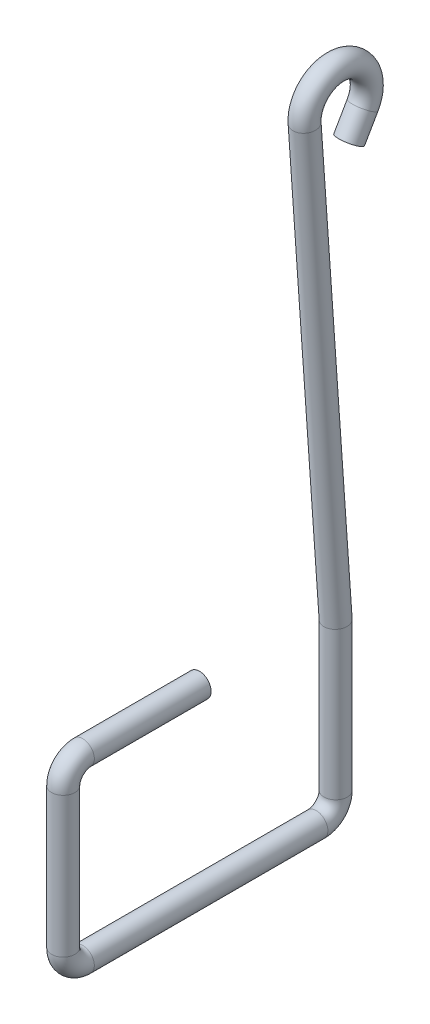
ISO-10303-21;
HEADER;
FILE_DESCRIPTION(('STEP AP214'),'2;1');
FILE_NAME('part.step','',(''),(''),'','','');
FILE_SCHEMA(('AUTOMOTIVE_DESIGN { 1 0 10303 214 1 1 1 1 }'));
ENDSEC;
DATA;
#1=APPLICATION_CONTEXT('core data for automotive mechanical design processes');
#2=APPLICATION_PROTOCOL_DEFINITION('international standard','automotive_design',2000,#1);
#3=PRODUCT_CONTEXT('',#1,'mechanical');
#4=PRODUCT('Part','Part','',(#3));
#5=PRODUCT_RELATED_PRODUCT_CATEGORY('part','',(#4));
#6=PRODUCT_DEFINITION_FORMATION('','',#4);
#7=PRODUCT_DEFINITION_CONTEXT('part definition',#1,'design');
#8=PRODUCT_DEFINITION('design','',#6,#7);
#9=PRODUCT_DEFINITION_SHAPE('','',#8);
#10=(LENGTH_UNIT() NAMED_UNIT(*) SI_UNIT(.MILLI.,.METRE.));
#11=(NAMED_UNIT(*) PLANE_ANGLE_UNIT() SI_UNIT($,.RADIAN.));
#12=(NAMED_UNIT(*) SI_UNIT($,.STERADIAN.) SOLID_ANGLE_UNIT());
#13=UNCERTAINTY_MEASURE_WITH_UNIT(LENGTH_MEASURE(1.E-05),#10,'distance_accuracy_value','');
#14=(GEOMETRIC_REPRESENTATION_CONTEXT(3) GLOBAL_UNCERTAINTY_ASSIGNED_CONTEXT((#13)) GLOBAL_UNIT_ASSIGNED_CONTEXT((#10,
#11,#12)) REPRESENTATION_CONTEXT('',''));
#15=CARTESIAN_POINT('',(0.,0.,0.));
#16=DIRECTION('',(0.,0.,1.));
#17=DIRECTION('',(1.,0.,0.));
#18=AXIS2_PLACEMENT_3D('',#15,#16,#17);
#19=CARTESIAN_POINT('',(0.,11.1,-0.692820323027547));
#20=DIRECTION('',(0.,-0.866025403784442,0.499999999999995));
#21=DIRECTION('',(0.,-0.499999999999995,-0.866025403784442));
#22=AXIS2_PLACEMENT_3D('',#19,#20,#21);
#23=CYLINDRICAL_SURFACE('',#22,0.3);
#24=CARTESIAN_POINT('',(0.,11.1,-0.692820323027547));
#25=DIRECTION('',(0.,-0.866025403784435,0.500000000000007));
#26=DIRECTION('',(0.,-0.500000000000007,-0.866025403784435));
#27=AXIS2_PLACEMENT_3D('',#24,#25,#26);
#28=CIRCLE('',#27,0.3);
#29=CARTESIAN_POINT('',(0.,10.95,-0.952627944162878));
#30=VERTEX_POINT('',#29);
#31=EDGE_CURVE('E38',#30,#30,#28,.T.);
#32=ORIENTED_EDGE('',*,*,#31,.T.);
#33=EDGE_LOOP('',(#32));
#34=FACE_BOUND('',#33,.T.);
#35=CARTESIAN_POINT('',(0.,10.5,-0.346410161513773));
#36=DIRECTION('',(0.,-0.866025403784435,0.500000000000007));
#37=DIRECTION('',(0.,-0.500000000000007,-0.866025403784435));
#38=AXIS2_PLACEMENT_3D('',#35,#36,#37);
#39=CIRCLE('',#38,0.3);
#40=CARTESIAN_POINT('',(0.,10.35,-0.606217782649104));
#41=VERTEX_POINT('',#40);
#42=EDGE_CURVE('E11',#41,#41,#39,.T.);
#43=ORIENTED_EDGE('',*,*,#42,.F.);
#44=EDGE_LOOP('',(#43));
#45=FACE_BOUND('',#44,.T.);
#46=ADVANCED_FACE('F32',(#34,#45),#23,.T.);
#47=CARTESIAN_POINT('',(0.,11.5,0.));
#48=DIRECTION('',(-1.,0.,0.));
#49=DIRECTION('',(0.,0.,1.));
#50=AXIS2_PLACEMENT_3D('',#47,#48,#49);
#51=TOROIDAL_SURFACE('',#50,0.799999999999998,0.3);
#52=CARTESIAN_POINT('',(0.,11.444347826087,0.798061924626623));
#53=DIRECTION('',(0.,0.997577405783281,0.0695652173913038));
#54=DIRECTION('',(0.,-0.0695652173913038,0.997577405783281));
#55=AXIS2_PLACEMENT_3D('',#52,#53,#54);
#56=CIRCLE('',#55,0.3);
#57=CARTESIAN_POINT('',(0.,11.4234782608696,1.09733514636161));
#58=VERTEX_POINT('',#57);
#59=EDGE_CURVE('E42',#58,#58,#56,.T.);
#60=CARTESIAN_POINT('',(0.,11.5,0.));
#61=DIRECTION('',(-1.,0.,0.));
#62=DIRECTION('',(0.,0.,1.));
#63=AXIS2_PLACEMENT_3D('',#60,#61,#62);
#64=CIRCLE('',#63,1.1);
#65=EDGE_CURVE('',#58,#30,#64,.T.);
#66=ORIENTED_EDGE('',*,*,#59,.T.);
#67=ORIENTED_EDGE('',*,*,#31,.F.);
#68=ORIENTED_EDGE('',*,*,#65,.T.);
#69=ORIENTED_EDGE('',*,*,#65,.F.);
#70=EDGE_LOOP('',(#66,#68,#67,#69));
#71=FACE_BOUND('',#70,.T.);
#72=ADVANCED_FACE('F91',(#71),#51,.T.);
#73=CARTESIAN_POINT('',(0.,0.,0.));
#74=DIRECTION('',(0.,0.997577405783281,0.0695652173913044));
#75=DIRECTION('',(0.,-0.0695652173913044,0.997577405783281));
#76=AXIS2_PLACEMENT_3D('',#73,#74,#75);
#77=CYLINDRICAL_SURFACE('',#76,0.3);
#78=CARTESIAN_POINT('',(0.,0.,0.));
#79=DIRECTION('',(0.,0.999394167929571,0.0348036938895799));
#80=DIRECTION('',(0.,0.0348036938895799,-0.999394167929571));
#81=AXIS2_PLACEMENT_3D('',#78,#79,#80);
#82=ELLIPSE('',#81,0.300181859797626,0.3);
#83=CARTESIAN_POINT('',(0.,0.0104474375596014,-0.300000000000002));
#84=VERTEX_POINT('',#83);
#85=EDGE_CURVE('E46',#84,#84,#82,.F.);
#86=ORIENTED_EDGE('',*,*,#85,.F.);
#87=EDGE_LOOP('',(#86));
#88=FACE_BOUND('',#87,.T.);
#89=ORIENTED_EDGE('',*,*,#59,.F.);
#90=EDGE_LOOP('',(#89));
#91=FACE_BOUND('',#90,.T.);
#92=ADVANCED_FACE('F95',(#88,#91),#77,.T.);
#93=CARTESIAN_POINT('',(0.,-3.8,0.));
#94=DIRECTION('',(0.,1.,0.));
#95=DIRECTION('',(0.,0.,1.));
#96=AXIS2_PLACEMENT_3D('',#93,#94,#95);
#97=CYLINDRICAL_SURFACE('',#96,0.3);
#98=CARTESIAN_POINT('',(0.,-3.8,0.));
#99=DIRECTION('',(0.,1.,0.));
#100=DIRECTION('',(1.,0.,0.));
#101=AXIS2_PLACEMENT_3D('',#98,#99,#100);
#102=CIRCLE('',#101,0.3);
#103=CARTESIAN_POINT('',(0.,-3.79999999999999,-0.300000000000001));
#104=VERTEX_POINT('',#103);
#105=EDGE_CURVE('E51',#104,#104,#102,.T.);
#106=ORIENTED_EDGE('',*,*,#105,.T.);
#107=EDGE_LOOP('',(#106));
#108=FACE_BOUND('',#107,.T.);
#109=ORIENTED_EDGE('',*,*,#85,.T.);
#110=EDGE_LOOP('',(#109));
#111=FACE_BOUND('',#110,.T.);
#112=ADVANCED_FACE('F101',(#108,#111),#97,.T.);
#113=CARTESIAN_POINT('',(0.,-3.8,0.5));
#114=DIRECTION('',(1.,0.,0.));
#115=DIRECTION('',(0.,0.,-1.));
#116=AXIS2_PLACEMENT_3D('',#113,#114,#115);
#117=TOROIDAL_SURFACE('',#116,0.500000000000001,0.3);
#118=CARTESIAN_POINT('',(0.,-4.3,0.500000000000004));
#119=DIRECTION('',(0.,0.,-1.));
#120=DIRECTION('',(1.,0.,0.));
#121=AXIS2_PLACEMENT_3D('',#118,#119,#120);
#122=CIRCLE('',#121,0.3);
#123=CARTESIAN_POINT('',(0.,-4.6,0.500000000000006));
#124=VERTEX_POINT('',#123);
#125=EDGE_CURVE('E54',#124,#124,#122,.T.);
#126=CARTESIAN_POINT('',(0.,-3.8,0.5));
#127=DIRECTION('',(1.,0.,0.));
#128=DIRECTION('',(0.,0.,-1.));
#129=AXIS2_PLACEMENT_3D('',#126,#127,#128);
#130=CIRCLE('',#129,0.800000000000001);
#131=EDGE_CURVE('',#124,#104,#130,.T.);
#132=ORIENTED_EDGE('',*,*,#125,.T.);
#133=ORIENTED_EDGE('',*,*,#105,.F.);
#134=ORIENTED_EDGE('',*,*,#131,.T.);
#135=ORIENTED_EDGE('',*,*,#131,.F.);
#136=EDGE_LOOP('',(#132,#134,#133,#135));
#137=FACE_BOUND('',#136,.T.);
#138=ADVANCED_FACE('F108',(#137),#117,.T.);
#139=CARTESIAN_POINT('',(0.,-4.3,6.5));
#140=DIRECTION('',(0.,0.,-1.));
#141=DIRECTION('',(0.,1.,0.));
#142=AXIS2_PLACEMENT_3D('',#139,#140,#141);
#143=CYLINDRICAL_SURFACE('',#142,0.3);
#144=CARTESIAN_POINT('',(0.,-4.3,6.5));
#145=DIRECTION('',(0.,0.,-1.));
#146=DIRECTION('',(1.,0.,0.));
#147=AXIS2_PLACEMENT_3D('',#144,#145,#146);
#148=CIRCLE('',#147,0.3);
#149=CARTESIAN_POINT('',(0.,-4.6,6.5));
#150=VERTEX_POINT('',#149);
#151=EDGE_CURVE('E57',#150,#150,#148,.T.);
#152=ORIENTED_EDGE('',*,*,#151,.T.);
#153=EDGE_LOOP('',(#152));
#154=FACE_BOUND('',#153,.T.);
#155=ORIENTED_EDGE('',*,*,#125,.F.);
#156=EDGE_LOOP('',(#155));
#157=FACE_BOUND('',#156,.T.);
#158=ADVANCED_FACE('F112',(#154,#157),#143,.T.);
#159=CARTESIAN_POINT('',(0.,-3.8,6.5));
#160=DIRECTION('',(1.,0.,0.));
#161=DIRECTION('',(0.,0.,-1.));
#162=AXIS2_PLACEMENT_3D('',#159,#160,#161);
#163=TOROIDAL_SURFACE('',#162,0.5,0.3);
#164=CARTESIAN_POINT('',(0.,-3.8,7.));
#165=DIRECTION('',(0.,-1.,0.));
#166=DIRECTION('',(1.,0.,0.));
#167=AXIS2_PLACEMENT_3D('',#164,#165,#166);
#168=CIRCLE('',#167,0.3);
#169=CARTESIAN_POINT('',(0.,-3.79999999999999,7.3));
#170=VERTEX_POINT('',#169);
#171=EDGE_CURVE('E60',#170,#170,#168,.T.);
#172=CARTESIAN_POINT('',(0.,-3.8,6.5));
#173=DIRECTION('',(1.,0.,0.));
#174=DIRECTION('',(0.,0.,-1.));
#175=AXIS2_PLACEMENT_3D('',#172,#173,#174);
#176=CIRCLE('',#175,0.8);
#177=EDGE_CURVE('',#170,#150,#176,.T.);
#178=ORIENTED_EDGE('',*,*,#171,.T.);
#179=ORIENTED_EDGE('',*,*,#151,.F.);
#180=ORIENTED_EDGE('',*,*,#177,.T.);
#181=ORIENTED_EDGE('',*,*,#177,.F.);
#182=EDGE_LOOP('',(#178,#180,#179,#181));
#183=FACE_BOUND('',#182,.T.);
#184=ADVANCED_FACE('F116',(#183),#163,.T.);
#185=CARTESIAN_POINT('',(0.,-0.200000000000004,7.));
#186=DIRECTION('',(0.,-1.,0.));
#187=DIRECTION('',(0.,0.,-1.));
#188=AXIS2_PLACEMENT_3D('',#185,#186,#187);
#189=CYLINDRICAL_SURFACE('',#188,0.3);
#190=CARTESIAN_POINT('',(0.,-0.200000000000004,7.));
#191=DIRECTION('',(0.,-1.,0.));
#192=DIRECTION('',(1.,0.,0.));
#193=AXIS2_PLACEMENT_3D('',#190,#191,#192);
#194=CIRCLE('',#193,0.3);
#195=CARTESIAN_POINT('',(0.,-0.200000000000006,7.3));
#196=VERTEX_POINT('',#195);
#197=EDGE_CURVE('E63',#196,#196,#194,.T.);
#198=ORIENTED_EDGE('',*,*,#197,.T.);
#199=EDGE_LOOP('',(#198));
#200=FACE_BOUND('',#199,.T.);
#201=ORIENTED_EDGE('',*,*,#171,.F.);
#202=EDGE_LOOP('',(#201));
#203=FACE_BOUND('',#202,.T.);
#204=ADVANCED_FACE('F120',(#200,#203),#189,.T.);
#205=CARTESIAN_POINT('',(0.,-0.2,6.5));
#206=DIRECTION('',(1.,0.,0.));
#207=DIRECTION('',(0.,0.,-1.));
#208=AXIS2_PLACEMENT_3D('',#205,#206,#207);
#209=TOROIDAL_SURFACE('',#208,0.5,0.3);
#210=CARTESIAN_POINT('',(0.,0.3,6.5));
#211=DIRECTION('',(0.,0.,1.));
#212=DIRECTION('',(1.,0.,0.));
#213=AXIS2_PLACEMENT_3D('',#210,#211,#212);
#214=CIRCLE('',#213,0.3);
#215=CARTESIAN_POINT('',(0.,0.6,6.49999999999999));
#216=VERTEX_POINT('',#215);
#217=EDGE_CURVE('E66',#216,#216,#214,.T.);
#218=CARTESIAN_POINT('',(0.,-0.2,6.5));
#219=DIRECTION('',(1.,0.,0.));
#220=DIRECTION('',(0.,0.,-1.));
#221=AXIS2_PLACEMENT_3D('',#218,#219,#220);
#222=CIRCLE('',#221,0.8);
#223=EDGE_CURVE('',#216,#196,#222,.T.);
#224=ORIENTED_EDGE('',*,*,#217,.T.);
#225=ORIENTED_EDGE('',*,*,#197,.F.);
#226=ORIENTED_EDGE('',*,*,#223,.T.);
#227=ORIENTED_EDGE('',*,*,#223,.F.);
#228=EDGE_LOOP('',(#224,#226,#225,#227));
#229=FACE_BOUND('',#228,.T.);
#230=ADVANCED_FACE('F73',(#229),#209,.T.);
#231=CARTESIAN_POINT('',(0.,0.3,6.5));
#232=DIRECTION('',(0.,0.,-1.));
#233=DIRECTION('',(0.,1.,0.));
#234=AXIS2_PLACEMENT_3D('',#231,#232,#233);
#235=CYLINDRICAL_SURFACE('',#234,0.3);
#236=ORIENTED_EDGE('',*,*,#217,.F.);
#237=EDGE_LOOP('',(#236));
#238=FACE_BOUND('',#237,.T.);
#239=CARTESIAN_POINT('',(0.,0.3,3.5));
#240=DIRECTION('',(0.,0.,1.));
#241=DIRECTION('',(1.,0.,0.));
#242=AXIS2_PLACEMENT_3D('',#239,#240,#241);
#243=CIRCLE('',#242,0.3);
#244=CARTESIAN_POINT('',(0.3,0.3,3.5));
#245=VERTEX_POINT('',#244);
#246=EDGE_CURVE('E67',#245,#245,#243,.T.);
#247=ORIENTED_EDGE('',*,*,#246,.T.);
#248=EDGE_LOOP('',(#247));
#249=FACE_BOUND('',#248,.T.);
#250=ADVANCED_FACE('F76',(#238,#249),#235,.T.);
#251=CARTESIAN_POINT('',(0.,0.3,3.5));
#252=DIRECTION('',(0.,0.,1.));
#253=DIRECTION('',(1.,0.,0.));
#254=AXIS2_PLACEMENT_3D('',#251,#252,#253);
#255=PLANE('',#254);
#256=ORIENTED_EDGE('',*,*,#246,.F.);
#257=EDGE_LOOP('',(#256));
#258=FACE_BOUND('',#257,.T.);
#259=ADVANCED_FACE('F79',(#258),#255,.F.);
#260=CARTESIAN_POINT('',(0.,10.5,-0.346410161513773));
#261=DIRECTION('',(0.,-0.866025403784435,0.500000000000007));
#262=DIRECTION('',(0.,-0.500000000000007,-0.866025403784435));
#263=AXIS2_PLACEMENT_3D('',#260,#261,#262);
#264=PLANE('',#263);
#265=ORIENTED_EDGE('',*,*,#42,.T.);
#266=EDGE_LOOP('',(#265));
#267=FACE_BOUND('',#266,.T.);
#268=ADVANCED_FACE('F84',(#267),#264,.T.);
#269=CLOSED_SHELL('',(#46,#72,#92,#112,#138,#158,#184,#204,#230,#250,#259,#268));
#270=MANIFOLD_SOLID_BREP('B2',#269);
#271=ADVANCED_BREP_SHAPE_REPRESENTATION('',(#18,#270),#14);
#272=SHAPE_DEFINITION_REPRESENTATION(#9,#271);
ENDSEC;
END-ISO-10303-21;
